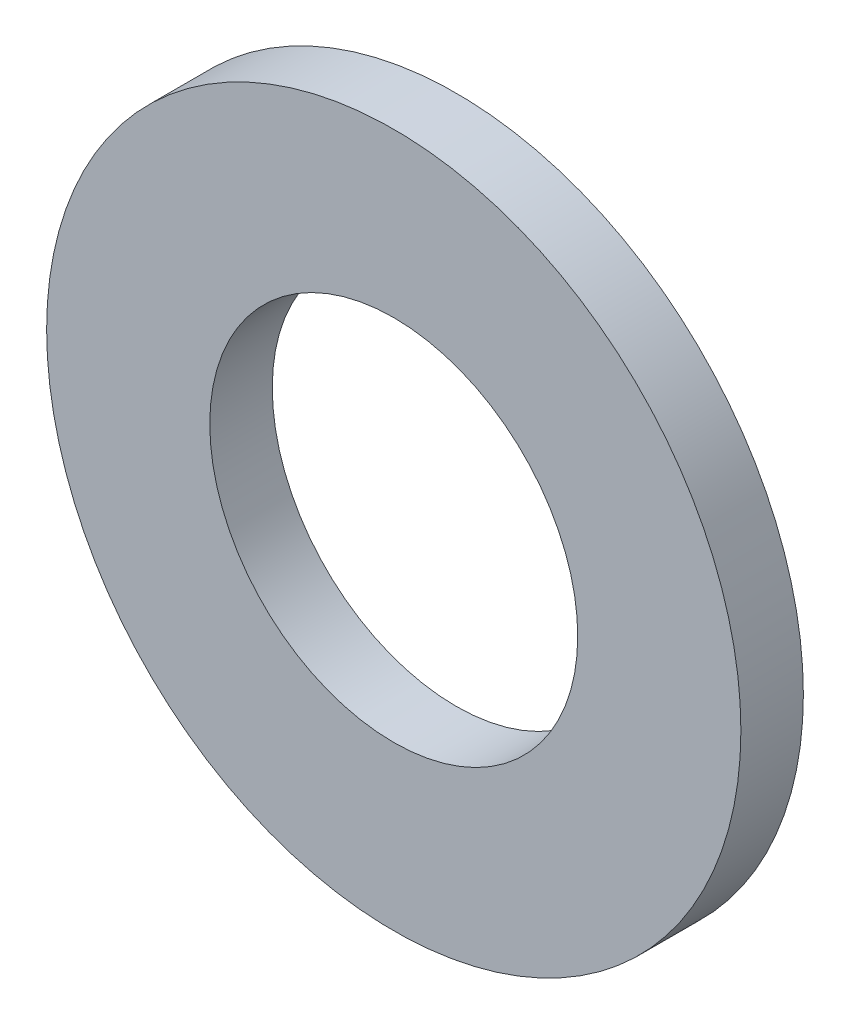
ISO-10303-21;
HEADER;
FILE_DESCRIPTION(('STEP AP214'),'2;1');
FILE_NAME('part.step','',(''),(''),'','','');
FILE_SCHEMA(('AUTOMOTIVE_DESIGN { 1 0 10303 214 1 1 1 1 }'));
ENDSEC;
DATA;
#1=APPLICATION_CONTEXT('core data for automotive mechanical design processes');
#2=APPLICATION_PROTOCOL_DEFINITION('international standard','automotive_design',2000,#1);
#3=PRODUCT_CONTEXT('',#1,'mechanical');
#4=PRODUCT('Part','Part','',(#3));
#5=PRODUCT_RELATED_PRODUCT_CATEGORY('part','',(#4));
#6=PRODUCT_DEFINITION_FORMATION('','',#4);
#7=PRODUCT_DEFINITION_CONTEXT('part definition',#1,'design');
#8=PRODUCT_DEFINITION('design','',#6,#7);
#9=PRODUCT_DEFINITION_SHAPE('','',#8);
#10=(LENGTH_UNIT() NAMED_UNIT(*) SI_UNIT(.MILLI.,.METRE.));
#11=(NAMED_UNIT(*) PLANE_ANGLE_UNIT() SI_UNIT($,.RADIAN.));
#12=(NAMED_UNIT(*) SI_UNIT($,.STERADIAN.) SOLID_ANGLE_UNIT());
#13=UNCERTAINTY_MEASURE_WITH_UNIT(LENGTH_MEASURE(1.E-05),#10,'distance_accuracy_value','');
#14=(GEOMETRIC_REPRESENTATION_CONTEXT(3) GLOBAL_UNCERTAINTY_ASSIGNED_CONTEXT((#13)) GLOBAL_UNIT_ASSIGNED_CONTEXT((#10,
#11,#12)) REPRESENTATION_CONTEXT('',''));
#15=CARTESIAN_POINT('',(0.,0.,0.));
#16=DIRECTION('',(0.,0.,1.));
#17=DIRECTION('',(1.,0.,0.));
#18=AXIS2_PLACEMENT_3D('',#15,#16,#17);
#19=CARTESIAN_POINT('',(0.,0.,-0.9));
#20=DIRECTION('',(0.,0.,1.));
#21=DIRECTION('',(1.,0.,0.));
#22=AXIS2_PLACEMENT_3D('',#19,#20,#21);
#23=CYLINDRICAL_SURFACE('',#22,5.);
#24=CARTESIAN_POINT('',(0.,0.,-0.9));
#25=DIRECTION('',(0.,0.,1.));
#26=DIRECTION('',(1.,0.,0.));
#27=AXIS2_PLACEMENT_3D('',#24,#25,#26);
#28=CIRCLE('',#27,5.);
#29=CARTESIAN_POINT('',(5.,0.,-0.9));
#30=VERTEX_POINT('',#29);
#31=EDGE_CURVE('E10',#30,#30,#28,.T.);
#32=ORIENTED_EDGE('',*,*,#31,.T.);
#33=EDGE_LOOP('',(#32));
#34=FACE_BOUND('',#33,.T.);
#35=CARTESIAN_POINT('',(0.,0.,0.));
#36=DIRECTION('',(0.,0.,1.));
#37=DIRECTION('',(1.,0.,0.));
#38=AXIS2_PLACEMENT_3D('',#35,#36,#37);
#39=CIRCLE('',#38,5.);
#40=CARTESIAN_POINT('',(5.,0.,0.));
#41=VERTEX_POINT('',#40);
#42=EDGE_CURVE('E31',#41,#41,#39,.T.);
#43=ORIENTED_EDGE('',*,*,#42,.F.);
#44=EDGE_LOOP('',(#43));
#45=FACE_BOUND('',#44,.T.);
#46=ADVANCED_FACE('F28',(#34,#45),#23,.T.);
#47=CARTESIAN_POINT('',(0.,0.,-0.9));
#48=DIRECTION('',(0.,0.,1.));
#49=DIRECTION('',(1.,0.,0.));
#50=AXIS2_PLACEMENT_3D('',#47,#48,#49);
#51=PLANE('',#50);
#52=CARTESIAN_POINT('',(0.,0.,-0.9));
#53=DIRECTION('',(0.,0.,1.));
#54=DIRECTION('',(1.,0.,0.));
#55=AXIS2_PLACEMENT_3D('',#52,#53,#54);
#56=CIRCLE('',#55,2.65);
#57=CARTESIAN_POINT('',(2.65,0.,-0.9));
#58=VERTEX_POINT('',#57);
#59=EDGE_CURVE('E38',#58,#58,#56,.T.);
#60=ORIENTED_EDGE('',*,*,#59,.T.);
#61=EDGE_LOOP('',(#60));
#62=FACE_BOUND('',#61,.T.);
#63=ORIENTED_EDGE('',*,*,#31,.F.);
#64=EDGE_LOOP('',(#63));
#65=FACE_BOUND('',#64,.T.);
#66=ADVANCED_FACE('F46',(#62,#65),#51,.F.);
#67=CARTESIAN_POINT('',(0.,0.,0.));
#68=DIRECTION('',(0.,0.,1.));
#69=DIRECTION('',(1.,0.,0.));
#70=AXIS2_PLACEMENT_3D('',#67,#68,#69);
#71=PLANE('',#70);
#72=CARTESIAN_POINT('',(0.,0.,0.));
#73=DIRECTION('',(0.,0.,1.));
#74=DIRECTION('',(1.,0.,0.));
#75=AXIS2_PLACEMENT_3D('',#72,#73,#74);
#76=CIRCLE('',#75,2.65);
#77=CARTESIAN_POINT('',(2.65,0.,0.));
#78=VERTEX_POINT('',#77);
#79=EDGE_CURVE('E40',#78,#78,#76,.T.);
#80=ORIENTED_EDGE('',*,*,#79,.F.);
#81=EDGE_LOOP('',(#80));
#82=FACE_BOUND('',#81,.T.);
#83=ORIENTED_EDGE('',*,*,#42,.T.);
#84=EDGE_LOOP('',(#83));
#85=FACE_BOUND('',#84,.T.);
#86=ADVANCED_FACE('F52',(#82,#85),#71,.T.);
#87=CARTESIAN_POINT('',(0.,0.,-0.9));
#88=DIRECTION('',(0.,0.,1.));
#89=DIRECTION('',(1.,0.,0.));
#90=AXIS2_PLACEMENT_3D('',#87,#88,#89);
#91=CYLINDRICAL_SURFACE('',#90,2.65);
#92=ORIENTED_EDGE('',*,*,#59,.F.);
#93=EDGE_LOOP('',(#92));
#94=FACE_BOUND('',#93,.T.);
#95=ORIENTED_EDGE('',*,*,#79,.T.);
#96=EDGE_LOOP('',(#95));
#97=FACE_BOUND('',#96,.T.);
#98=ADVANCED_FACE('F49',(#94,#97),#91,.F.);
#99=CLOSED_SHELL('',(#46,#66,#86,#98));
#100=MANIFOLD_SOLID_BREP('B2',#99);
#101=ADVANCED_BREP_SHAPE_REPRESENTATION('',(#18,#100),#14);
#102=SHAPE_DEFINITION_REPRESENTATION(#9,#101);
ENDSEC;
END-ISO-10303-21;
